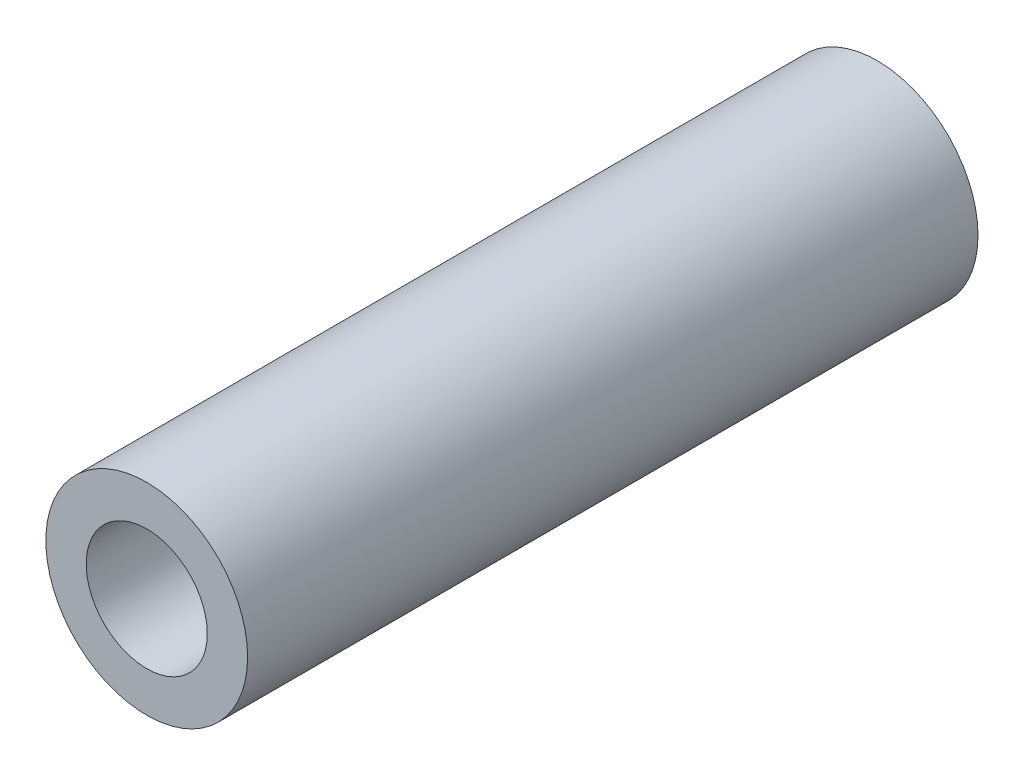
ISO-10303-21;
HEADER;
FILE_DESCRIPTION(('STEP AP214'),'2;1');
FILE_NAME('part.step','',(''),(''),'','','');
FILE_SCHEMA(('AUTOMOTIVE_DESIGN { 1 0 10303 214 1 1 1 1 }'));
ENDSEC;
DATA;
#1=APPLICATION_CONTEXT('core data for automotive mechanical design processes');
#2=APPLICATION_PROTOCOL_DEFINITION('international standard','automotive_design',2000,#1);
#3=PRODUCT_CONTEXT('',#1,'mechanical');
#4=PRODUCT('Part','Part','',(#3));
#5=PRODUCT_RELATED_PRODUCT_CATEGORY('part','',(#4));
#6=PRODUCT_DEFINITION_FORMATION('','',#4);
#7=PRODUCT_DEFINITION_CONTEXT('part definition',#1,'design');
#8=PRODUCT_DEFINITION('design','',#6,#7);
#9=PRODUCT_DEFINITION_SHAPE('','',#8);
#10=(LENGTH_UNIT() NAMED_UNIT(*) SI_UNIT(.MILLI.,.METRE.));
#11=(NAMED_UNIT(*) PLANE_ANGLE_UNIT() SI_UNIT($,.RADIAN.));
#12=(NAMED_UNIT(*) SI_UNIT($,.STERADIAN.) SOLID_ANGLE_UNIT());
#13=UNCERTAINTY_MEASURE_WITH_UNIT(LENGTH_MEASURE(1.E-05),#10,'distance_accuracy_value','');
#14=(GEOMETRIC_REPRESENTATION_CONTEXT(3) GLOBAL_UNCERTAINTY_ASSIGNED_CONTEXT((#13)) GLOBAL_UNIT_ASSIGNED_CONTEXT((#10,
#11,#12)) REPRESENTATION_CONTEXT('',''));
#15=CARTESIAN_POINT('',(0.,0.,0.));
#16=DIRECTION('',(0.,0.,1.));
#17=DIRECTION('',(1.,0.,0.));
#18=AXIS2_PLACEMENT_3D('',#15,#16,#17);
#19=CARTESIAN_POINT('',(0.,0.,18.1));
#20=DIRECTION('',(0.,0.,1.));
#21=DIRECTION('',(1.,0.,0.));
#22=AXIS2_PLACEMENT_3D('',#19,#20,#21);
#23=PLANE('',#22);
#24=CARTESIAN_POINT('',(0.,0.,18.1));
#25=DIRECTION('',(0.,0.,1.));
#26=DIRECTION('',(1.,0.,0.));
#27=AXIS2_PLACEMENT_3D('',#24,#25,#26);
#28=CIRCLE('',#27,2.5);
#29=CARTESIAN_POINT('',(2.5,0.,18.1));
#30=VERTEX_POINT('',#29);
#31=EDGE_CURVE('E10',#30,#30,#28,.T.);
#32=ORIENTED_EDGE('',*,*,#31,.T.);
#33=EDGE_LOOP('',(#32));
#34=FACE_BOUND('',#33,.T.);
#35=CARTESIAN_POINT('',(0.,0.,18.1));
#36=DIRECTION('',(0.,0.,1.));
#37=DIRECTION('',(1.,0.,0.));
#38=AXIS2_PLACEMENT_3D('',#35,#36,#37);
#39=CIRCLE('',#38,1.5);
#40=CARTESIAN_POINT('',(1.5,0.,18.1));
#41=VERTEX_POINT('',#40);
#42=EDGE_CURVE('E55',#41,#41,#39,.T.);
#43=ORIENTED_EDGE('',*,*,#42,.F.);
#44=EDGE_LOOP('',(#43));
#45=FACE_BOUND('',#44,.T.);
#46=ADVANCED_FACE('F40',(#34,#45),#23,.T.);
#47=CARTESIAN_POINT('',(0.,0.,0.));
#48=DIRECTION('',(0.,0.,1.));
#49=DIRECTION('',(1.,0.,0.));
#50=AXIS2_PLACEMENT_3D('',#47,#48,#49);
#51=PLANE('',#50);
#52=CARTESIAN_POINT('',(0.,0.,0.));
#53=DIRECTION('',(0.,0.,1.));
#54=DIRECTION('',(1.,0.,0.));
#55=AXIS2_PLACEMENT_3D('',#52,#53,#54);
#56=CIRCLE('',#55,2.5);
#57=CARTESIAN_POINT('',(2.5,0.,0.));
#58=VERTEX_POINT('',#57);
#59=EDGE_CURVE('E44',#58,#58,#56,.T.);
#60=ORIENTED_EDGE('',*,*,#59,.F.);
#61=EDGE_LOOP('',(#60));
#62=FACE_BOUND('',#61,.T.);
#63=CARTESIAN_POINT('',(0.,0.,0.));
#64=DIRECTION('',(0.,0.,1.));
#65=DIRECTION('',(1.,0.,0.));
#66=AXIS2_PLACEMENT_3D('',#63,#64,#65);
#67=CIRCLE('',#66,1.5);
#68=CARTESIAN_POINT('',(1.5,0.,0.));
#69=VERTEX_POINT('',#68);
#70=EDGE_CURVE('E57',#69,#69,#67,.T.);
#71=ORIENTED_EDGE('',*,*,#70,.T.);
#72=EDGE_LOOP('',(#71));
#73=FACE_BOUND('',#72,.T.);
#74=ADVANCED_FACE('F67',(#62,#73),#51,.F.);
#75=CARTESIAN_POINT('',(0.,0.,18.1));
#76=DIRECTION('',(0.,0.,-1.));
#77=DIRECTION('',(-1.,0.,0.));
#78=AXIS2_PLACEMENT_3D('',#75,#76,#77);
#79=CYLINDRICAL_SURFACE('',#78,2.5);
#80=ORIENTED_EDGE('',*,*,#31,.F.);
#81=EDGE_LOOP('',(#80));
#82=FACE_BOUND('',#81,.T.);
#83=ORIENTED_EDGE('',*,*,#59,.T.);
#84=EDGE_LOOP('',(#83));
#85=FACE_BOUND('',#84,.T.);
#86=ADVANCED_FACE('F42',(#82,#85),#79,.T.);
#87=CARTESIAN_POINT('',(0.,0.,18.1));
#88=DIRECTION('',(0.,0.,-1.));
#89=DIRECTION('',(-1.,0.,0.));
#90=AXIS2_PLACEMENT_3D('',#87,#88,#89);
#91=CYLINDRICAL_SURFACE('',#90,1.5);
#92=ORIENTED_EDGE('',*,*,#42,.T.);
#93=EDGE_LOOP('',(#92));
#94=FACE_BOUND('',#93,.T.);
#95=ORIENTED_EDGE('',*,*,#70,.F.);
#96=EDGE_LOOP('',(#95));
#97=FACE_BOUND('',#96,.T.);
#98=ADVANCED_FACE('F63',(#94,#97),#91,.F.);
#99=CLOSED_SHELL('',(#46,#74,#86,#98));
#100=MANIFOLD_SOLID_BREP('B2',#99);
#101=ADVANCED_BREP_SHAPE_REPRESENTATION('',(#18,#100),#14);
#102=SHAPE_DEFINITION_REPRESENTATION(#9,#101);
ENDSEC;
END-ISO-10303-21;
